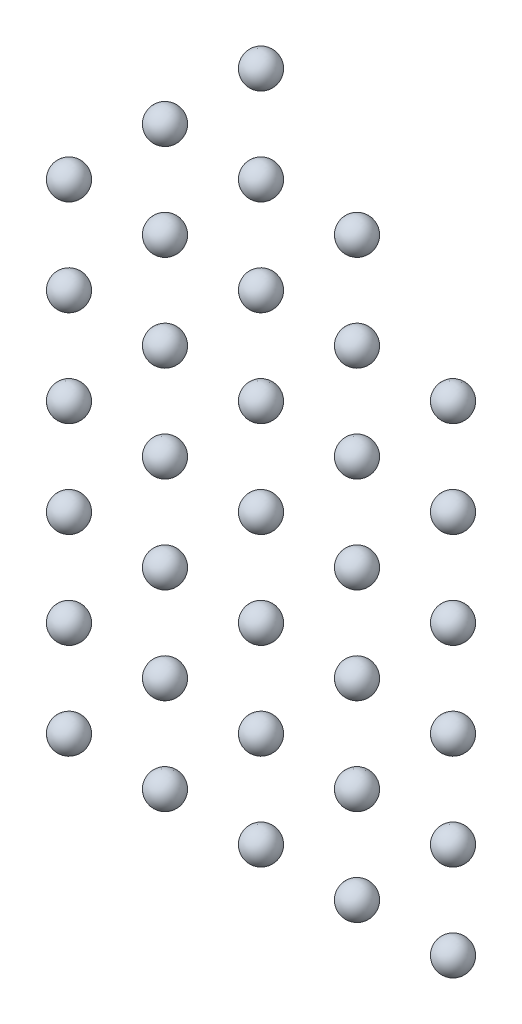
ISO-10303-21;
HEADER;
FILE_DESCRIPTION(('STEP AP214'),'2;1');
FILE_NAME('part.step','',(''),(''),'','','');
FILE_SCHEMA(('AUTOMOTIVE_DESIGN { 1 0 10303 214 1 1 1 1 }'));
ENDSEC;
DATA;
#1=APPLICATION_CONTEXT('core data for automotive mechanical design processes');
#2=APPLICATION_PROTOCOL_DEFINITION('international standard','automotive_design',2000,#1);
#3=PRODUCT_CONTEXT('',#1,'mechanical');
#4=PRODUCT('Part','Part','',(#3));
#5=PRODUCT_RELATED_PRODUCT_CATEGORY('part','',(#4));
#6=PRODUCT_DEFINITION_FORMATION('','',#4);
#7=PRODUCT_DEFINITION_CONTEXT('part definition',#1,'design');
#8=PRODUCT_DEFINITION('design','',#6,#7);
#9=PRODUCT_DEFINITION_SHAPE('','',#8);
#10=(LENGTH_UNIT() NAMED_UNIT(*) SI_UNIT(.MILLI.,.METRE.));
#11=(NAMED_UNIT(*) PLANE_ANGLE_UNIT() SI_UNIT($,.RADIAN.));
#12=(NAMED_UNIT(*) SI_UNIT($,.STERADIAN.) SOLID_ANGLE_UNIT());
#13=UNCERTAINTY_MEASURE_WITH_UNIT(LENGTH_MEASURE(1.E-05),#10,'distance_accuracy_value','');
#14=(GEOMETRIC_REPRESENTATION_CONTEXT(3) GLOBAL_UNCERTAINTY_ASSIGNED_CONTEXT((#13)) GLOBAL_UNIT_ASSIGNED_CONTEXT((#10,
#11,#12)) REPRESENTATION_CONTEXT('',''));
#15=CARTESIAN_POINT('',(0.,0.,0.));
#16=DIRECTION('',(0.,0.,1.));
#17=DIRECTION('',(1.,0.,0.));
#18=AXIS2_PLACEMENT_3D('',#15,#16,#17);
#19=CARTESIAN_POINT('',(6.,21.,0.));
#20=DIRECTION('',(-1.,0.,0.));
#21=DIRECTION('',(0.,1.,0.));
#22=AXIS2_PLACEMENT_3D('',#19,#20,#21);
#23=SPHERICAL_SURFACE('',#22,0.5);
#24=CARTESIAN_POINT('',(5.5,21.,0.));
#25=VERTEX_POINT('',#24);
#26=VERTEX_LOOP('',#25);
#27=FACE_BOUND('',#26,.T.);
#28=ADVANCED_FACE('F41',(#27),#23,.T.);
#29=CLOSED_SHELL('',(#28));
#30=MANIFOLD_SOLID_BREP('B2',#29);
#31=CARTESIAN_POINT('',(3.,18.,0.));
#32=DIRECTION('',(-1.,0.,0.));
#33=DIRECTION('',(0.,1.,0.));
#34=AXIS2_PLACEMENT_3D('',#31,#32,#33);
#35=SPHERICAL_SURFACE('',#34,0.5);
#36=CARTESIAN_POINT('',(2.5,18.,0.));
#37=VERTEX_POINT('',#36);
#38=VERTEX_LOOP('',#37);
#39=FACE_BOUND('',#38,.T.);
#40=ADVANCED_FACE('F61',(#39),#35,.T.);
#41=CLOSED_SHELL('',(#40));
#42=MANIFOLD_SOLID_BREP('B6',#41);
#43=CARTESIAN_POINT('',(6.,18.,0.));
#44=DIRECTION('',(-1.,0.,0.));
#45=DIRECTION('',(0.,1.,0.));
#46=AXIS2_PLACEMENT_3D('',#43,#44,#45);
#47=SPHERICAL_SURFACE('',#46,0.5);
#48=CARTESIAN_POINT('',(5.5,18.,0.));
#49=VERTEX_POINT('',#48);
#50=VERTEX_LOOP('',#49);
#51=FACE_BOUND('',#50,.T.);
#52=ADVANCED_FACE('F81',(#51),#47,.T.);
#53=CLOSED_SHELL('',(#52));
#54=MANIFOLD_SOLID_BREP('B37',#53);
#55=CARTESIAN_POINT('',(9.,18.,0.));
#56=DIRECTION('',(-1.,0.,0.));
#57=DIRECTION('',(0.,1.,0.));
#58=AXIS2_PLACEMENT_3D('',#55,#56,#57);
#59=SPHERICAL_SURFACE('',#58,0.5);
#60=CARTESIAN_POINT('',(8.5,18.,0.));
#61=VERTEX_POINT('',#60);
#62=VERTEX_LOOP('',#61);
#63=FACE_BOUND('',#62,.T.);
#64=ADVANCED_FACE('F101',(#63),#59,.T.);
#65=CLOSED_SHELL('',(#64));
#66=MANIFOLD_SOLID_BREP('B57',#65);
#67=CARTESIAN_POINT('',(12.,15.,0.));
#68=DIRECTION('',(-1.,0.,0.));
#69=DIRECTION('',(0.,1.,0.));
#70=AXIS2_PLACEMENT_3D('',#67,#68,#69);
#71=SPHERICAL_SURFACE('',#70,0.5);
#72=CARTESIAN_POINT('',(11.5,15.,0.));
#73=VERTEX_POINT('',#72);
#74=VERTEX_LOOP('',#73);
#75=FACE_BOUND('',#74,.T.);
#76=ADVANCED_FACE('F121',(#75),#71,.T.);
#77=CLOSED_SHELL('',(#76));
#78=MANIFOLD_SOLID_BREP('B77',#77);
#79=CARTESIAN_POINT('',(9.,15.,0.));
#80=DIRECTION('',(-1.,0.,0.));
#81=DIRECTION('',(0.,1.,0.));
#82=AXIS2_PLACEMENT_3D('',#79,#80,#81);
#83=SPHERICAL_SURFACE('',#82,0.5);
#84=CARTESIAN_POINT('',(8.5,15.,0.));
#85=VERTEX_POINT('',#84);
#86=VERTEX_LOOP('',#85);
#87=FACE_BOUND('',#86,.T.);
#88=ADVANCED_FACE('F141',(#87),#83,.T.);
#89=CLOSED_SHELL('',(#88));
#90=MANIFOLD_SOLID_BREP('B97',#89);
#91=CARTESIAN_POINT('',(6.,15.,0.));
#92=DIRECTION('',(-1.,0.,0.));
#93=DIRECTION('',(0.,1.,0.));
#94=AXIS2_PLACEMENT_3D('',#91,#92,#93);
#95=SPHERICAL_SURFACE('',#94,0.5);
#96=CARTESIAN_POINT('',(5.5,15.,0.));
#97=VERTEX_POINT('',#96);
#98=VERTEX_LOOP('',#97);
#99=FACE_BOUND('',#98,.T.);
#100=ADVANCED_FACE('F161',(#99),#95,.T.);
#101=CLOSED_SHELL('',(#100));
#102=MANIFOLD_SOLID_BREP('B117',#101);
#103=CARTESIAN_POINT('',(3.,15.,0.));
#104=DIRECTION('',(-1.,0.,0.));
#105=DIRECTION('',(0.,1.,0.));
#106=AXIS2_PLACEMENT_3D('',#103,#104,#105);
#107=SPHERICAL_SURFACE('',#106,0.5);
#108=CARTESIAN_POINT('',(2.5,15.,0.));
#109=VERTEX_POINT('',#108);
#110=VERTEX_LOOP('',#109);
#111=FACE_BOUND('',#110,.T.);
#112=ADVANCED_FACE('F181',(#111),#107,.T.);
#113=CLOSED_SHELL('',(#112));
#114=MANIFOLD_SOLID_BREP('B137',#113);
#115=CARTESIAN_POINT('',(0.,15.,0.));
#116=DIRECTION('',(-1.,0.,0.));
#117=DIRECTION('',(0.,1.,0.));
#118=AXIS2_PLACEMENT_3D('',#115,#116,#117);
#119=SPHERICAL_SURFACE('',#118,0.5);
#120=CARTESIAN_POINT('',(-0.5,15.,0.));
#121=VERTEX_POINT('',#120);
#122=VERTEX_LOOP('',#121);
#123=FACE_BOUND('',#122,.T.);
#124=ADVANCED_FACE('F201',(#123),#119,.T.);
#125=CLOSED_SHELL('',(#124));
#126=MANIFOLD_SOLID_BREP('B157',#125);
#127=CARTESIAN_POINT('',(12.,12.,0.));
#128=DIRECTION('',(-1.,0.,0.));
#129=DIRECTION('',(0.,1.,0.));
#130=AXIS2_PLACEMENT_3D('',#127,#128,#129);
#131=SPHERICAL_SURFACE('',#130,0.5);
#132=CARTESIAN_POINT('',(11.5,12.,0.));
#133=VERTEX_POINT('',#132);
#134=VERTEX_LOOP('',#133);
#135=FACE_BOUND('',#134,.T.);
#136=ADVANCED_FACE('F221',(#135),#131,.T.);
#137=CLOSED_SHELL('',(#136));
#138=MANIFOLD_SOLID_BREP('B177',#137);
#139=CARTESIAN_POINT('',(9.,12.,0.));
#140=DIRECTION('',(-1.,0.,0.));
#141=DIRECTION('',(0.,1.,0.));
#142=AXIS2_PLACEMENT_3D('',#139,#140,#141);
#143=SPHERICAL_SURFACE('',#142,0.5);
#144=CARTESIAN_POINT('',(8.5,12.,0.));
#145=VERTEX_POINT('',#144);
#146=VERTEX_LOOP('',#145);
#147=FACE_BOUND('',#146,.T.);
#148=ADVANCED_FACE('F241',(#147),#143,.T.);
#149=CLOSED_SHELL('',(#148));
#150=MANIFOLD_SOLID_BREP('B197',#149);
#151=CARTESIAN_POINT('',(6.,12.,0.));
#152=DIRECTION('',(-1.,0.,0.));
#153=DIRECTION('',(0.,1.,0.));
#154=AXIS2_PLACEMENT_3D('',#151,#152,#153);
#155=SPHERICAL_SURFACE('',#154,0.5);
#156=CARTESIAN_POINT('',(5.5,12.,0.));
#157=VERTEX_POINT('',#156);
#158=VERTEX_LOOP('',#157);
#159=FACE_BOUND('',#158,.T.);
#160=ADVANCED_FACE('F261',(#159),#155,.T.);
#161=CLOSED_SHELL('',(#160));
#162=MANIFOLD_SOLID_BREP('B217',#161);
#163=CARTESIAN_POINT('',(3.,12.,0.));
#164=DIRECTION('',(-1.,0.,0.));
#165=DIRECTION('',(0.,1.,0.));
#166=AXIS2_PLACEMENT_3D('',#163,#164,#165);
#167=SPHERICAL_SURFACE('',#166,0.5);
#168=CARTESIAN_POINT('',(2.5,12.,0.));
#169=VERTEX_POINT('',#168);
#170=VERTEX_LOOP('',#169);
#171=FACE_BOUND('',#170,.T.);
#172=ADVANCED_FACE('F281',(#171),#167,.T.);
#173=CLOSED_SHELL('',(#172));
#174=MANIFOLD_SOLID_BREP('B237',#173);
#175=CARTESIAN_POINT('',(0.,12.,0.));
#176=DIRECTION('',(-1.,0.,0.));
#177=DIRECTION('',(0.,1.,0.));
#178=AXIS2_PLACEMENT_3D('',#175,#176,#177);
#179=SPHERICAL_SURFACE('',#178,0.5);
#180=CARTESIAN_POINT('',(-0.5,12.,0.));
#181=VERTEX_POINT('',#180);
#182=VERTEX_LOOP('',#181);
#183=FACE_BOUND('',#182,.T.);
#184=ADVANCED_FACE('F301',(#183),#179,.T.);
#185=CLOSED_SHELL('',(#184));
#186=MANIFOLD_SOLID_BREP('B257',#185);
#187=CARTESIAN_POINT('',(12.,9.,0.));
#188=DIRECTION('',(-1.,0.,0.));
#189=DIRECTION('',(0.,1.,0.));
#190=AXIS2_PLACEMENT_3D('',#187,#188,#189);
#191=SPHERICAL_SURFACE('',#190,0.5);
#192=CARTESIAN_POINT('',(11.5,9.,0.));
#193=VERTEX_POINT('',#192);
#194=VERTEX_LOOP('',#193);
#195=FACE_BOUND('',#194,.T.);
#196=ADVANCED_FACE('F321',(#195),#191,.T.);
#197=CLOSED_SHELL('',(#196));
#198=MANIFOLD_SOLID_BREP('B277',#197);
#199=CARTESIAN_POINT('',(9.,9.,0.));
#200=DIRECTION('',(-1.,0.,0.));
#201=DIRECTION('',(0.,1.,0.));
#202=AXIS2_PLACEMENT_3D('',#199,#200,#201);
#203=SPHERICAL_SURFACE('',#202,0.5);
#204=CARTESIAN_POINT('',(8.5,9.,0.));
#205=VERTEX_POINT('',#204);
#206=VERTEX_LOOP('',#205);
#207=FACE_BOUND('',#206,.T.);
#208=ADVANCED_FACE('F341',(#207),#203,.T.);
#209=CLOSED_SHELL('',(#208));
#210=MANIFOLD_SOLID_BREP('B297',#209);
#211=CARTESIAN_POINT('',(6.,9.,0.));
#212=DIRECTION('',(-1.,0.,0.));
#213=DIRECTION('',(0.,1.,0.));
#214=AXIS2_PLACEMENT_3D('',#211,#212,#213);
#215=SPHERICAL_SURFACE('',#214,0.5);
#216=CARTESIAN_POINT('',(5.5,9.,0.));
#217=VERTEX_POINT('',#216);
#218=VERTEX_LOOP('',#217);
#219=FACE_BOUND('',#218,.T.);
#220=ADVANCED_FACE('F361',(#219),#215,.T.);
#221=CLOSED_SHELL('',(#220));
#222=MANIFOLD_SOLID_BREP('B317',#221);
#223=CARTESIAN_POINT('',(3.,9.,0.));
#224=DIRECTION('',(-1.,0.,0.));
#225=DIRECTION('',(0.,1.,0.));
#226=AXIS2_PLACEMENT_3D('',#223,#224,#225);
#227=SPHERICAL_SURFACE('',#226,0.5);
#228=CARTESIAN_POINT('',(2.5,9.,0.));
#229=VERTEX_POINT('',#228);
#230=VERTEX_LOOP('',#229);
#231=FACE_BOUND('',#230,.T.);
#232=ADVANCED_FACE('F381',(#231),#227,.T.);
#233=CLOSED_SHELL('',(#232));
#234=MANIFOLD_SOLID_BREP('B337',#233);
#235=CARTESIAN_POINT('',(0.,9.,0.));
#236=DIRECTION('',(-1.,0.,0.));
#237=DIRECTION('',(0.,1.,0.));
#238=AXIS2_PLACEMENT_3D('',#235,#236,#237);
#239=SPHERICAL_SURFACE('',#238,0.5);
#240=CARTESIAN_POINT('',(-0.5,9.,0.));
#241=VERTEX_POINT('',#240);
#242=VERTEX_LOOP('',#241);
#243=FACE_BOUND('',#242,.T.);
#244=ADVANCED_FACE('F401',(#243),#239,.T.);
#245=CLOSED_SHELL('',(#244));
#246=MANIFOLD_SOLID_BREP('B357',#245);
#247=CARTESIAN_POINT('',(12.,6.,0.));
#248=DIRECTION('',(-1.,0.,0.));
#249=DIRECTION('',(0.,1.,0.));
#250=AXIS2_PLACEMENT_3D('',#247,#248,#249);
#251=SPHERICAL_SURFACE('',#250,0.5);
#252=CARTESIAN_POINT('',(11.5,6.,0.));
#253=VERTEX_POINT('',#252);
#254=VERTEX_LOOP('',#253);
#255=FACE_BOUND('',#254,.T.);
#256=ADVANCED_FACE('F421',(#255),#251,.T.);
#257=CLOSED_SHELL('',(#256));
#258=MANIFOLD_SOLID_BREP('B377',#257);
#259=CARTESIAN_POINT('',(9.,6.,0.));
#260=DIRECTION('',(-1.,0.,0.));
#261=DIRECTION('',(0.,1.,0.));
#262=AXIS2_PLACEMENT_3D('',#259,#260,#261);
#263=SPHERICAL_SURFACE('',#262,0.5);
#264=CARTESIAN_POINT('',(8.5,6.,0.));
#265=VERTEX_POINT('',#264);
#266=VERTEX_LOOP('',#265);
#267=FACE_BOUND('',#266,.T.);
#268=ADVANCED_FACE('F441',(#267),#263,.T.);
#269=CLOSED_SHELL('',(#268));
#270=MANIFOLD_SOLID_BREP('B397',#269);
#271=CARTESIAN_POINT('',(6.,6.,0.));
#272=DIRECTION('',(-1.,0.,0.));
#273=DIRECTION('',(0.,1.,0.));
#274=AXIS2_PLACEMENT_3D('',#271,#272,#273);
#275=SPHERICAL_SURFACE('',#274,0.5);
#276=CARTESIAN_POINT('',(5.5,6.,0.));
#277=VERTEX_POINT('',#276);
#278=VERTEX_LOOP('',#277);
#279=FACE_BOUND('',#278,.T.);
#280=ADVANCED_FACE('F461',(#279),#275,.T.);
#281=CLOSED_SHELL('',(#280));
#282=MANIFOLD_SOLID_BREP('B417',#281);
#283=CARTESIAN_POINT('',(3.,6.,0.));
#284=DIRECTION('',(-1.,0.,0.));
#285=DIRECTION('',(0.,1.,0.));
#286=AXIS2_PLACEMENT_3D('',#283,#284,#285);
#287=SPHERICAL_SURFACE('',#286,0.5);
#288=CARTESIAN_POINT('',(2.5,6.,0.));
#289=VERTEX_POINT('',#288);
#290=VERTEX_LOOP('',#289);
#291=FACE_BOUND('',#290,.T.);
#292=ADVANCED_FACE('F481',(#291),#287,.T.);
#293=CLOSED_SHELL('',(#292));
#294=MANIFOLD_SOLID_BREP('B437',#293);
#295=CARTESIAN_POINT('',(0.,6.,0.));
#296=DIRECTION('',(-1.,0.,0.));
#297=DIRECTION('',(0.,1.,0.));
#298=AXIS2_PLACEMENT_3D('',#295,#296,#297);
#299=SPHERICAL_SURFACE('',#298,0.5);
#300=CARTESIAN_POINT('',(-0.5,6.,0.));
#301=VERTEX_POINT('',#300);
#302=VERTEX_LOOP('',#301);
#303=FACE_BOUND('',#302,.T.);
#304=ADVANCED_FACE('F501',(#303),#299,.T.);
#305=CLOSED_SHELL('',(#304));
#306=MANIFOLD_SOLID_BREP('B457',#305);
#307=CARTESIAN_POINT('',(12.,3.,0.));
#308=DIRECTION('',(-1.,0.,0.));
#309=DIRECTION('',(0.,1.,0.));
#310=AXIS2_PLACEMENT_3D('',#307,#308,#309);
#311=SPHERICAL_SURFACE('',#310,0.5);
#312=CARTESIAN_POINT('',(11.5,3.,0.));
#313=VERTEX_POINT('',#312);
#314=VERTEX_LOOP('',#313);
#315=FACE_BOUND('',#314,.T.);
#316=ADVANCED_FACE('F521',(#315),#311,.T.);
#317=CLOSED_SHELL('',(#316));
#318=MANIFOLD_SOLID_BREP('B477',#317);
#319=CARTESIAN_POINT('',(9.,3.,0.));
#320=DIRECTION('',(-1.,0.,0.));
#321=DIRECTION('',(0.,1.,0.));
#322=AXIS2_PLACEMENT_3D('',#319,#320,#321);
#323=SPHERICAL_SURFACE('',#322,0.5);
#324=CARTESIAN_POINT('',(8.5,3.,0.));
#325=VERTEX_POINT('',#324);
#326=VERTEX_LOOP('',#325);
#327=FACE_BOUND('',#326,.T.);
#328=ADVANCED_FACE('F541',(#327),#323,.T.);
#329=CLOSED_SHELL('',(#328));
#330=MANIFOLD_SOLID_BREP('B497',#329);
#331=CARTESIAN_POINT('',(6.,3.,0.));
#332=DIRECTION('',(-1.,0.,0.));
#333=DIRECTION('',(0.,1.,0.));
#334=AXIS2_PLACEMENT_3D('',#331,#332,#333);
#335=SPHERICAL_SURFACE('',#334,0.5);
#336=CARTESIAN_POINT('',(5.5,3.,0.));
#337=VERTEX_POINT('',#336);
#338=VERTEX_LOOP('',#337);
#339=FACE_BOUND('',#338,.T.);
#340=ADVANCED_FACE('F561',(#339),#335,.T.);
#341=CLOSED_SHELL('',(#340));
#342=MANIFOLD_SOLID_BREP('B517',#341);
#343=CARTESIAN_POINT('',(3.,3.,0.));
#344=DIRECTION('',(-1.,0.,0.));
#345=DIRECTION('',(0.,1.,0.));
#346=AXIS2_PLACEMENT_3D('',#343,#344,#345);
#347=SPHERICAL_SURFACE('',#346,0.5);
#348=CARTESIAN_POINT('',(2.5,3.,0.));
#349=VERTEX_POINT('',#348);
#350=VERTEX_LOOP('',#349);
#351=FACE_BOUND('',#350,.T.);
#352=ADVANCED_FACE('F581',(#351),#347,.T.);
#353=CLOSED_SHELL('',(#352));
#354=MANIFOLD_SOLID_BREP('B537',#353);
#355=CARTESIAN_POINT('',(0.,3.,0.));
#356=DIRECTION('',(-1.,0.,0.));
#357=DIRECTION('',(0.,1.,0.));
#358=AXIS2_PLACEMENT_3D('',#355,#356,#357);
#359=SPHERICAL_SURFACE('',#358,0.5);
#360=CARTESIAN_POINT('',(-0.5,3.,0.));
#361=VERTEX_POINT('',#360);
#362=VERTEX_LOOP('',#361);
#363=FACE_BOUND('',#362,.T.);
#364=ADVANCED_FACE('F601',(#363),#359,.T.);
#365=CLOSED_SHELL('',(#364));
#366=MANIFOLD_SOLID_BREP('B557',#365);
#367=CARTESIAN_POINT('',(12.,0.,0.));
#368=DIRECTION('',(-1.,0.,0.));
#369=DIRECTION('',(0.,1.,0.));
#370=AXIS2_PLACEMENT_3D('',#367,#368,#369);
#371=SPHERICAL_SURFACE('',#370,0.5);
#372=CARTESIAN_POINT('',(11.5,0.,0.));
#373=VERTEX_POINT('',#372);
#374=VERTEX_LOOP('',#373);
#375=FACE_BOUND('',#374,.T.);
#376=ADVANCED_FACE('F621',(#375),#371,.T.);
#377=CLOSED_SHELL('',(#376));
#378=MANIFOLD_SOLID_BREP('B577',#377);
#379=CARTESIAN_POINT('',(9.,0.,0.));
#380=DIRECTION('',(-1.,0.,0.));
#381=DIRECTION('',(0.,1.,0.));
#382=AXIS2_PLACEMENT_3D('',#379,#380,#381);
#383=SPHERICAL_SURFACE('',#382,0.5);
#384=CARTESIAN_POINT('',(8.5,0.,0.));
#385=VERTEX_POINT('',#384);
#386=VERTEX_LOOP('',#385);
#387=FACE_BOUND('',#386,.T.);
#388=ADVANCED_FACE('F641',(#387),#383,.T.);
#389=CLOSED_SHELL('',(#388));
#390=MANIFOLD_SOLID_BREP('B597',#389);
#391=CARTESIAN_POINT('',(6.,0.,0.));
#392=DIRECTION('',(-1.,0.,0.));
#393=DIRECTION('',(0.,1.,0.));
#394=AXIS2_PLACEMENT_3D('',#391,#392,#393);
#395=SPHERICAL_SURFACE('',#394,0.5);
#396=CARTESIAN_POINT('',(5.5,0.,0.));
#397=VERTEX_POINT('',#396);
#398=VERTEX_LOOP('',#397);
#399=FACE_BOUND('',#398,.T.);
#400=ADVANCED_FACE('F661',(#399),#395,.T.);
#401=CLOSED_SHELL('',(#400));
#402=MANIFOLD_SOLID_BREP('B617',#401);
#403=CARTESIAN_POINT('',(3.,0.,0.));
#404=DIRECTION('',(-1.,0.,0.));
#405=DIRECTION('',(0.,1.,0.));
#406=AXIS2_PLACEMENT_3D('',#403,#404,#405);
#407=SPHERICAL_SURFACE('',#406,0.5);
#408=CARTESIAN_POINT('',(2.5,0.,0.));
#409=VERTEX_POINT('',#408);
#410=VERTEX_LOOP('',#409);
#411=FACE_BOUND('',#410,.T.);
#412=ADVANCED_FACE('F680',(#411),#407,.T.);
#413=CLOSED_SHELL('',(#412));
#414=MANIFOLD_SOLID_BREP('B637',#413);
#415=CARTESIAN_POINT('',(0.,0.,0.));
#416=DIRECTION('',(-1.,0.,0.));
#417=DIRECTION('',(0.,1.,0.));
#418=AXIS2_PLACEMENT_3D('',#415,#416,#417);
#419=SPHERICAL_SURFACE('',#418,0.5);
#420=CARTESIAN_POINT('',(-0.5,0.,0.));
#421=VERTEX_POINT('',#420);
#422=VERTEX_LOOP('',#421);
#423=FACE_BOUND('',#422,.T.);
#424=ADVANCED_FACE('F694',(#423),#419,.T.);
#425=CLOSED_SHELL('',(#424));
#426=MANIFOLD_SOLID_BREP('B657',#425);
#427=ADVANCED_BREP_SHAPE_REPRESENTATION('',(#18,#30,#42,#54,#66,#78,#90,#102,#114,#126,#138,
#150,#162,#174,#186,#198,#210,#222,#234,#246,#258,#270,#282,#294,#306,#318,#330,#342,#354,#366,
#378,#390,#402,#414,#426),#14);
#428=SHAPE_DEFINITION_REPRESENTATION(#9,#427);
ENDSEC;
END-ISO-10303-21;
